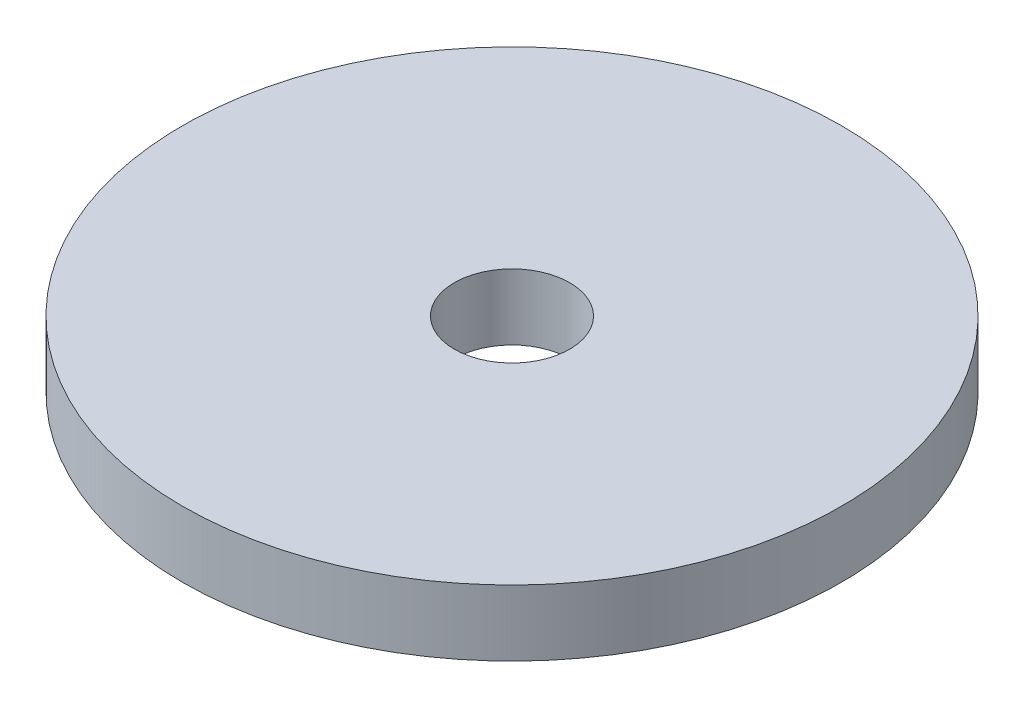
ISO-10303-21;
HEADER;
FILE_DESCRIPTION(('STEP AP214'),'2;1');
FILE_NAME('part.step','',(''),(''),'','','');
FILE_SCHEMA(('AUTOMOTIVE_DESIGN { 1 0 10303 214 1 1 1 1 }'));
ENDSEC;
DATA;
#1=APPLICATION_CONTEXT('core data for automotive mechanical design processes');
#2=APPLICATION_PROTOCOL_DEFINITION('international standard','automotive_design',2000,#1);
#3=PRODUCT_CONTEXT('',#1,'mechanical');
#4=PRODUCT('Part','Part','',(#3));
#5=PRODUCT_RELATED_PRODUCT_CATEGORY('part','',(#4));
#6=PRODUCT_DEFINITION_FORMATION('','',#4);
#7=PRODUCT_DEFINITION_CONTEXT('part definition',#1,'design');
#8=PRODUCT_DEFINITION('design','',#6,#7);
#9=PRODUCT_DEFINITION_SHAPE('','',#8);
#10=(LENGTH_UNIT() NAMED_UNIT(*) SI_UNIT(.MILLI.,.METRE.));
#11=(NAMED_UNIT(*) PLANE_ANGLE_UNIT() SI_UNIT($,.RADIAN.));
#12=(NAMED_UNIT(*) SI_UNIT($,.STERADIAN.) SOLID_ANGLE_UNIT());
#13=UNCERTAINTY_MEASURE_WITH_UNIT(LENGTH_MEASURE(1.E-05),#10,'distance_accuracy_value','');
#14=(GEOMETRIC_REPRESENTATION_CONTEXT(3) GLOBAL_UNCERTAINTY_ASSIGNED_CONTEXT((#13)) GLOBAL_UNIT_ASSIGNED_CONTEXT((#10,
#11,#12)) REPRESENTATION_CONTEXT('',''));
#15=CARTESIAN_POINT('',(0.,0.,0.));
#16=DIRECTION('',(0.,0.,1.));
#17=DIRECTION('',(1.,0.,0.));
#18=AXIS2_PLACEMENT_3D('',#15,#16,#17);
#19=CARTESIAN_POINT('',(0.,2.,0.));
#20=DIRECTION('',(0.,1.,0.));
#21=DIRECTION('',(0.,0.,1.));
#22=AXIS2_PLACEMENT_3D('',#19,#20,#21);
#23=PLANE('',#22);
#24=CARTESIAN_POINT('',(0.,2.,0.));
#25=DIRECTION('',(0.,1.,0.));
#26=DIRECTION('',(0.,0.,1.));
#27=AXIS2_PLACEMENT_3D('',#24,#25,#26);
#28=CIRCLE('',#27,10.);
#29=CARTESIAN_POINT('',(0.,2.,10.));
#30=VERTEX_POINT('',#29);
#31=EDGE_CURVE('E10',#30,#30,#28,.T.);
#32=ORIENTED_EDGE('',*,*,#31,.T.);
#33=EDGE_LOOP('',(#32));
#34=FACE_BOUND('',#33,.T.);
#35=CARTESIAN_POINT('',(0.,2.,0.));
#36=DIRECTION('',(0.,1.,0.));
#37=DIRECTION('',(0.,0.,1.));
#38=AXIS2_PLACEMENT_3D('',#35,#36,#37);
#39=CIRCLE('',#38,1.75);
#40=CARTESIAN_POINT('',(0.,2.,1.75));
#41=VERTEX_POINT('',#40);
#42=EDGE_CURVE('E42',#41,#41,#39,.T.);
#43=ORIENTED_EDGE('',*,*,#42,.F.);
#44=EDGE_LOOP('',(#43));
#45=FACE_BOUND('',#44,.T.);
#46=ADVANCED_FACE('F31',(#34,#45),#23,.T.);
#47=CARTESIAN_POINT('',(0.,0.,0.));
#48=DIRECTION('',(0.,1.,0.));
#49=DIRECTION('',(0.,0.,1.));
#50=AXIS2_PLACEMENT_3D('',#47,#48,#49);
#51=PLANE('',#50);
#52=CARTESIAN_POINT('',(0.,0.,0.));
#53=DIRECTION('',(0.,1.,0.));
#54=DIRECTION('',(0.,0.,1.));
#55=AXIS2_PLACEMENT_3D('',#52,#53,#54);
#56=CIRCLE('',#55,10.);
#57=CARTESIAN_POINT('',(0.,0.,10.));
#58=VERTEX_POINT('',#57);
#59=EDGE_CURVE('E35',#58,#58,#56,.T.);
#60=ORIENTED_EDGE('',*,*,#59,.F.);
#61=EDGE_LOOP('',(#60));
#62=FACE_BOUND('',#61,.T.);
#63=CARTESIAN_POINT('',(0.,0.,0.));
#64=DIRECTION('',(0.,1.,0.));
#65=DIRECTION('',(0.,0.,1.));
#66=AXIS2_PLACEMENT_3D('',#63,#64,#65);
#67=CIRCLE('',#66,1.75);
#68=CARTESIAN_POINT('',(0.,0.,1.75));
#69=VERTEX_POINT('',#68);
#70=EDGE_CURVE('E44',#69,#69,#67,.T.);
#71=ORIENTED_EDGE('',*,*,#70,.T.);
#72=EDGE_LOOP('',(#71));
#73=FACE_BOUND('',#72,.T.);
#74=ADVANCED_FACE('F54',(#62,#73),#51,.F.);
#75=CARTESIAN_POINT('',(0.,2.,0.));
#76=DIRECTION('',(0.,-1.,0.));
#77=DIRECTION('',(0.,0.,-1.));
#78=AXIS2_PLACEMENT_3D('',#75,#76,#77);
#79=CYLINDRICAL_SURFACE('',#78,10.);
#80=ORIENTED_EDGE('',*,*,#31,.F.);
#81=EDGE_LOOP('',(#80));
#82=FACE_BOUND('',#81,.T.);
#83=ORIENTED_EDGE('',*,*,#59,.T.);
#84=EDGE_LOOP('',(#83));
#85=FACE_BOUND('',#84,.T.);
#86=ADVANCED_FACE('F33',(#82,#85),#79,.T.);
#87=CARTESIAN_POINT('',(0.,2.,0.));
#88=DIRECTION('',(0.,-1.,0.));
#89=DIRECTION('',(0.,0.,-1.));
#90=AXIS2_PLACEMENT_3D('',#87,#88,#89);
#91=CYLINDRICAL_SURFACE('',#90,1.75);
#92=ORIENTED_EDGE('',*,*,#42,.T.);
#93=EDGE_LOOP('',(#92));
#94=FACE_BOUND('',#93,.T.);
#95=ORIENTED_EDGE('',*,*,#70,.F.);
#96=EDGE_LOOP('',(#95));
#97=FACE_BOUND('',#96,.T.);
#98=ADVANCED_FACE('F50',(#94,#97),#91,.F.);
#99=CLOSED_SHELL('',(#46,#74,#86,#98));
#100=MANIFOLD_SOLID_BREP('B2',#99);
#101=ADVANCED_BREP_SHAPE_REPRESENTATION('',(#18,#100),#14);
#102=SHAPE_DEFINITION_REPRESENTATION(#9,#101);
ENDSEC;
END-ISO-10303-21;
